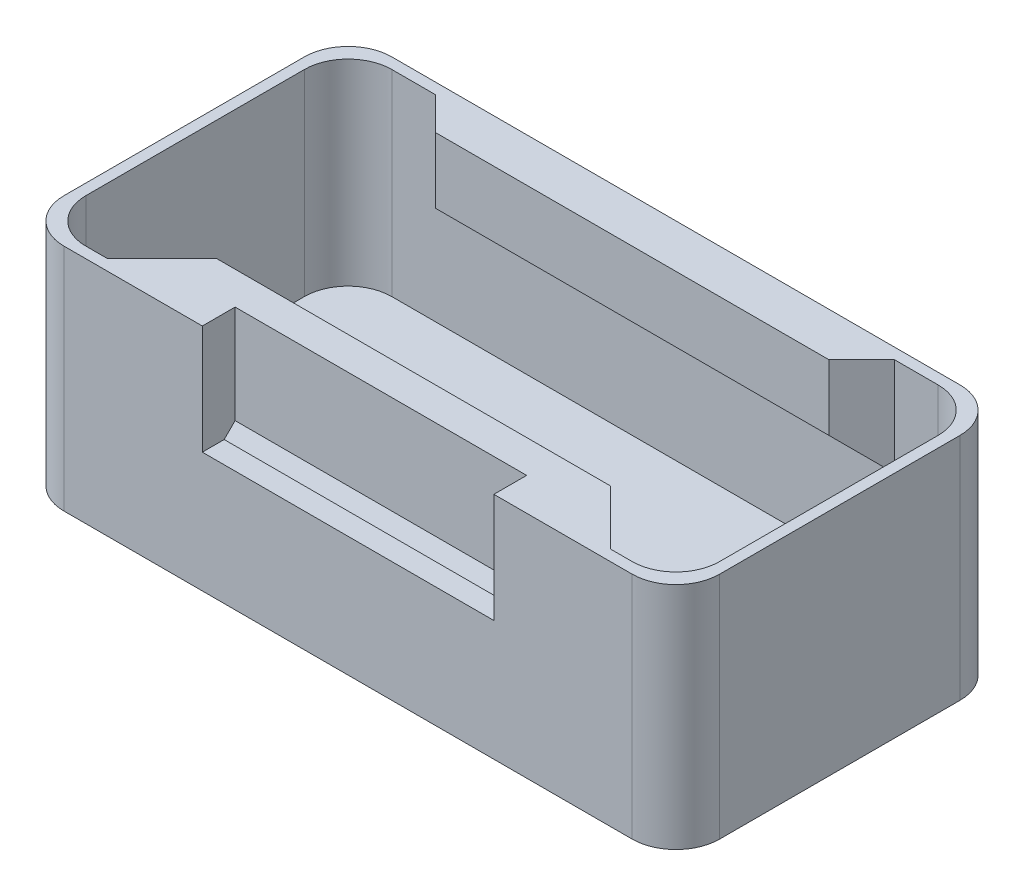
ISO-10303-21;
HEADER;
FILE_DESCRIPTION(('STEP AP214'),'2;1');
FILE_NAME('part.step','',(''),(''),'','','');
FILE_SCHEMA(('AUTOMOTIVE_DESIGN { 1 0 10303 214 1 1 1 1 }'));
ENDSEC;
DATA;
#1=APPLICATION_CONTEXT('core data for automotive mechanical design processes');
#2=APPLICATION_PROTOCOL_DEFINITION('international standard','automotive_design',2000,#1);
#3=PRODUCT_CONTEXT('',#1,'mechanical');
#4=PRODUCT('Part','Part','',(#3));
#5=PRODUCT_RELATED_PRODUCT_CATEGORY('part','',(#4));
#6=PRODUCT_DEFINITION_FORMATION('','',#4);
#7=PRODUCT_DEFINITION_CONTEXT('part definition',#1,'design');
#8=PRODUCT_DEFINITION('design','',#6,#7);
#9=PRODUCT_DEFINITION_SHAPE('','',#8);
#10=(LENGTH_UNIT() NAMED_UNIT(*) SI_UNIT(.MILLI.,.METRE.));
#11=(NAMED_UNIT(*) PLANE_ANGLE_UNIT() SI_UNIT($,.RADIAN.));
#12=(NAMED_UNIT(*) SI_UNIT($,.STERADIAN.) SOLID_ANGLE_UNIT());
#13=UNCERTAINTY_MEASURE_WITH_UNIT(LENGTH_MEASURE(1.E-05),#10,'distance_accuracy_value','');
#14=(GEOMETRIC_REPRESENTATION_CONTEXT(3) GLOBAL_UNCERTAINTY_ASSIGNED_CONTEXT((#13)) GLOBAL_UNIT_ASSIGNED_CONTEXT((#10,
#11,#12)) REPRESENTATION_CONTEXT('',''));
#15=CARTESIAN_POINT('',(0.,0.,0.));
#16=DIRECTION('',(0.,0.,1.));
#17=DIRECTION('',(1.,0.,0.));
#18=AXIS2_PLACEMENT_3D('',#15,#16,#17);
#19=CARTESIAN_POINT('',(0.,5.,0.));
#20=DIRECTION('',(0.,0.,-1.));
#21=DIRECTION('',(-1.,0.,0.));
#22=AXIS2_PLACEMENT_3D('',#19,#20,#21);
#23=PLANE('',#22);
#24=DIRECTION('',(0.,1.,0.));
#25=VECTOR('',#24,1.);
#26=CARTESIAN_POINT('',(83.2977765473117,55.,0.));
#27=LINE('',#26,#25);
#28=CARTESIAN_POINT('',(83.2977765473117,55.,0.));
#29=VERTEX_POINT('',#28);
#30=CARTESIAN_POINT('',(83.2977765473117,105.,0.));
#31=VERTEX_POINT('',#30);
#32=EDGE_CURVE('E485',#29,#31,#27,.T.);
#33=ORIENTED_EDGE('',*,*,#32,.T.);
#34=DIRECTION('',(1.,0.,0.));
#35=VECTOR('',#34,1.);
#36=CARTESIAN_POINT('',(0.,105.,0.));
#37=LINE('',#36,#35);
#38=CARTESIAN_POINT('',(20.,105.,0.));
#39=VERTEX_POINT('',#38);
#40=EDGE_CURVE('E363',#39,#31,#37,.T.);
#41=ORIENTED_EDGE('',*,*,#40,.F.);
#42=DIRECTION('',(0.,-1.,0.));
#43=VECTOR('',#42,1.);
#44=CARTESIAN_POINT('',(20.,5.,0.));
#45=LINE('',#44,#43);
#46=CARTESIAN_POINT('',(20.,0.,0.));
#47=VERTEX_POINT('',#46);
#48=EDGE_CURVE('E394',#39,#47,#45,.T.);
#49=ORIENTED_EDGE('',*,*,#48,.T.);
#50=DIRECTION('',(1.,0.,0.));
#51=VECTOR('',#50,1.);
#52=CARTESIAN_POINT('',(0.,0.,0.));
#53=LINE('',#52,#51);
#54=CARTESIAN_POINT('',(280.,0.,0.));
#55=VERTEX_POINT('',#54);
#56=EDGE_CURVE('E372',#47,#55,#53,.T.);
#57=ORIENTED_EDGE('',*,*,#56,.T.);
#58=DIRECTION('',(0.,-1.,0.));
#59=VECTOR('',#58,1.);
#60=CARTESIAN_POINT('',(280.,5.,0.));
#61=LINE('',#60,#59);
#62=CARTESIAN_POINT('',(280.,105.,0.));
#63=VERTEX_POINT('',#62);
#64=EDGE_CURVE('E397',#55,#63,#61,.F.);
#65=ORIENTED_EDGE('',*,*,#64,.T.);
#66=CARTESIAN_POINT('',(216.702223452688,105.,0.));
#67=VERTEX_POINT('',#66);
#68=EDGE_CURVE('E265',#67,#63,#37,.T.);
#69=ORIENTED_EDGE('',*,*,#68,.F.);
#70=DIRECTION('',(0.,1.,0.));
#71=VECTOR('',#70,1.);
#72=CARTESIAN_POINT('',(216.702223452688,55.,0.));
#73=LINE('',#72,#71);
#74=CARTESIAN_POINT('',(216.702223452688,55.,0.));
#75=VERTEX_POINT('',#74);
#76=EDGE_CURVE('E50',#75,#67,#73,.T.);
#77=ORIENTED_EDGE('',*,*,#76,.F.);
#78=DIRECTION('',(1.,0.,0.));
#79=VECTOR('',#78,1.);
#80=CARTESIAN_POINT('',(0.,55.,0.));
#81=LINE('',#80,#79);
#82=EDGE_CURVE('E253',#29,#75,#81,.T.);
#83=ORIENTED_EDGE('',*,*,#82,.F.);
#84=EDGE_LOOP('',(#33,#41,#49,#57,#65,#69,#77,#83));
#85=FACE_BOUND('',#84,.T.);
#86=ADVANCED_FACE('F35',(#85),#23,.F.);
#87=CARTESIAN_POINT('',(0.,105.,0.));
#88=DIRECTION('',(0.,1.,0.));
#89=DIRECTION('',(0.,0.,1.));
#90=AXIS2_PLACEMENT_3D('',#87,#88,#89);
#91=PLANE('',#90);
#92=DIRECTION('',(0.,0.,1.));
#93=VECTOR('',#92,1.);
#94=CARTESIAN_POINT('',(5.,105.,-145.));
#95=LINE('',#94,#93);
#96=CARTESIAN_POINT('',(5.,105.,-125.));
#97=VERTEX_POINT('',#96);
#98=CARTESIAN_POINT('',(5.,105.,-25.));
#99=VERTEX_POINT('',#98);
#100=EDGE_CURVE('E342',#97,#99,#95,.T.);
#101=ORIENTED_EDGE('',*,*,#100,.F.);
#102=CARTESIAN_POINT('',(25.,105.,-125.));
#103=DIRECTION('',(0.,1.,0.));
#104=DIRECTION('',(0.,0.,1.));
#105=AXIS2_PLACEMENT_3D('',#102,#103,#104);
#106=CIRCLE('',#105,20.);
#107=CARTESIAN_POINT('',(25.,105.,-145.));
#108=VERTEX_POINT('',#107);
#109=EDGE_CURVE('E444',#97,#108,#106,.F.);
#110=ORIENTED_EDGE('',*,*,#109,.T.);
#111=DIRECTION('',(-1.,0.,0.));
#112=VECTOR('',#111,1.);
#113=CARTESIAN_POINT('',(295.,105.,-145.));
#114=LINE('',#113,#112);
#115=CARTESIAN_POINT('',(45.0000000000001,105.,-145.));
#116=VERTEX_POINT('',#115);
#117=EDGE_CURVE('E343',#116,#108,#114,.T.);
#118=ORIENTED_EDGE('',*,*,#117,.F.);
#119=DIRECTION('',(0.707106781186544,0.,0.707106781186551));
#120=VECTOR('',#119,1.);
#121=CARTESIAN_POINT('',(60.,105.,-130.));
#122=LINE('',#121,#120);
#123=CARTESIAN_POINT('',(60.,105.,-130.));
#124=VERTEX_POINT('',#123);
#125=EDGE_CURVE('E463',#116,#124,#122,.T.);
#126=ORIENTED_EDGE('',*,*,#125,.T.);
#127=DIRECTION('',(-1.,0.,0.));
#128=VECTOR('',#127,1.);
#129=CARTESIAN_POINT('',(60.,105.,-130.));
#130=LINE('',#129,#128);
#131=CARTESIAN_POINT('',(240.,105.,-130.));
#132=VERTEX_POINT('',#131);
#133=EDGE_CURVE('E291',#132,#124,#130,.T.);
#134=ORIENTED_EDGE('',*,*,#133,.F.);
#135=DIRECTION('',(0.707106781186543,0.,-0.707106781186552));
#136=VECTOR('',#135,1.);
#137=CARTESIAN_POINT('',(240.,105.,-130.));
#138=LINE('',#137,#136);
#139=CARTESIAN_POINT('',(255.,105.,-145.));
#140=VERTEX_POINT('',#139);
#141=EDGE_CURVE('E461',#132,#140,#138,.T.);
#142=ORIENTED_EDGE('',*,*,#141,.T.);
#143=CARTESIAN_POINT('',(275.,105.,-145.));
#144=VERTEX_POINT('',#143);
#145=EDGE_CURVE('E339',#144,#140,#114,.T.);
#146=ORIENTED_EDGE('',*,*,#145,.F.);
#147=CARTESIAN_POINT('',(275.,105.,-125.));
#148=DIRECTION('',(0.,1.,0.));
#149=DIRECTION('',(0.,0.,1.));
#150=AXIS2_PLACEMENT_3D('',#147,#148,#149);
#151=CIRCLE('',#150,20.);
#152=CARTESIAN_POINT('',(295.,105.,-125.));
#153=VERTEX_POINT('',#152);
#154=EDGE_CURVE('E437',#144,#153,#151,.F.);
#155=ORIENTED_EDGE('',*,*,#154,.T.);
#156=DIRECTION('',(0.,0.,-1.));
#157=VECTOR('',#156,1.);
#158=CARTESIAN_POINT('',(295.,105.,-5.));
#159=LINE('',#158,#157);
#160=CARTESIAN_POINT('',(295.,105.,-25.));
#161=VERTEX_POINT('',#160);
#162=EDGE_CURVE('E350',#161,#153,#159,.T.);
#163=ORIENTED_EDGE('',*,*,#162,.F.);
#164=CARTESIAN_POINT('',(275.,105.,-25.));
#165=DIRECTION('',(0.,1.,0.));
#166=DIRECTION('',(0.,0.,1.));
#167=AXIS2_PLACEMENT_3D('',#164,#165,#166);
#168=CIRCLE('',#167,20.);
#169=CARTESIAN_POINT('',(275.,105.,-5.));
#170=VERTEX_POINT('',#169);
#171=EDGE_CURVE('E439',#161,#170,#168,.F.);
#172=ORIENTED_EDGE('',*,*,#171,.T.);
#173=DIRECTION('',(1.,0.,0.));
#174=VECTOR('',#173,1.);
#175=CARTESIAN_POINT('',(5.,105.,-5.));
#176=LINE('',#175,#174);
#177=CARTESIAN_POINT('',(265.,105.,-5.));
#178=VERTEX_POINT('',#177);
#179=EDGE_CURVE('E346',#178,#170,#176,.T.);
#180=ORIENTED_EDGE('',*,*,#179,.F.);
#181=DIRECTION('',(-0.707106781186544,0.,-0.707106781186551));
#182=VECTOR('',#181,1.);
#183=CARTESIAN_POINT('',(240.,105.,-30.0000000000002));
#184=LINE('',#183,#182);
#185=CARTESIAN_POINT('',(240.,105.,-30.));
#186=VERTEX_POINT('',#185);
#187=EDGE_CURVE('E479',#178,#186,#184,.T.);
#188=ORIENTED_EDGE('',*,*,#187,.T.);
#189=DIRECTION('',(1.,0.,0.));
#190=VECTOR('',#189,1.);
#191=CARTESIAN_POINT('',(60.,105.,-30.));
#192=LINE('',#191,#190);
#193=CARTESIAN_POINT('',(60.,105.,-30.));
#194=VERTEX_POINT('',#193);
#195=EDGE_CURVE('E276',#194,#186,#192,.T.);
#196=ORIENTED_EDGE('',*,*,#195,.F.);
#197=DIRECTION('',(-0.707106781186544,0.,0.707106781186551));
#198=VECTOR('',#197,1.);
#199=CARTESIAN_POINT('',(60.,105.,-30.0000000000002));
#200=LINE('',#199,#198);
#201=CARTESIAN_POINT('',(35.0000000000001,105.,-5.));
#202=VERTEX_POINT('',#201);
#203=EDGE_CURVE('E477',#194,#202,#200,.T.);
#204=ORIENTED_EDGE('',*,*,#203,.T.);
#205=CARTESIAN_POINT('',(25.,105.,-5.));
#206=VERTEX_POINT('',#205);
#207=EDGE_CURVE('E347',#206,#202,#176,.T.);
#208=ORIENTED_EDGE('',*,*,#207,.F.);
#209=CARTESIAN_POINT('',(25.,105.,-25.));
#210=DIRECTION('',(0.,1.,0.));
#211=DIRECTION('',(0.,0.,1.));
#212=AXIS2_PLACEMENT_3D('',#209,#210,#211);
#213=CIRCLE('',#212,20.);
#214=EDGE_CURVE('E442',#206,#99,#213,.F.);
#215=ORIENTED_EDGE('',*,*,#214,.T.);
#216=EDGE_LOOP('',(#101,#110,#118,#126,#134,#142,#146,#155,#163,#172,#180,#188,#196,#204,#208,#215));
#217=FACE_BOUND('',#216,.T.);
#218=ORIENTED_EDGE('',*,*,#40,.T.);
#219=DIRECTION('',(0.,0.,-1.));
#220=VECTOR('',#219,1.);
#221=CARTESIAN_POINT('',(83.2977765473117,105.,0.));
#222=LINE('',#221,#220);
#223=CARTESIAN_POINT('',(83.2977765473117,105.,-15.));
#224=VERTEX_POINT('',#223);
#225=EDGE_CURVE('E261',#31,#224,#222,.T.);
#226=ORIENTED_EDGE('',*,*,#225,.T.);
#227=DIRECTION('',(1.,0.,0.));
#228=VECTOR('',#227,1.);
#229=CARTESIAN_POINT('',(0.,105.,-15.));
#230=LINE('',#229,#228);
#231=CARTESIAN_POINT('',(216.702223452688,105.,-15.));
#232=VERTEX_POINT('',#231);
#233=EDGE_CURVE('E506',#224,#232,#230,.T.);
#234=ORIENTED_EDGE('',*,*,#233,.T.);
#235=DIRECTION('',(0.,0.,-1.));
#236=VECTOR('',#235,1.);
#237=CARTESIAN_POINT('',(216.702223452688,105.,0.));
#238=LINE('',#237,#236);
#239=EDGE_CURVE('E496',#67,#232,#238,.T.);
#240=ORIENTED_EDGE('',*,*,#239,.F.);
#241=ORIENTED_EDGE('',*,*,#68,.T.);
#242=CARTESIAN_POINT('',(280.,105.,-20.));
#243=DIRECTION('',(0.,1.,0.));
#244=DIRECTION('',(0.,0.,1.));
#245=AXIS2_PLACEMENT_3D('',#242,#243,#244);
#246=CIRCLE('',#245,20.);
#247=CARTESIAN_POINT('',(300.,105.,-20.));
#248=VERTEX_POINT('',#247);
#249=EDGE_CURVE('E453',#63,#248,#246,.T.);
#250=ORIENTED_EDGE('',*,*,#249,.T.);
#251=DIRECTION('',(0.,0.,-1.));
#252=VECTOR('',#251,1.);
#253=CARTESIAN_POINT('',(300.,105.,0.));
#254=LINE('',#253,#252);
#255=CARTESIAN_POINT('',(300.,105.,-130.));
#256=VERTEX_POINT('',#255);
#257=EDGE_CURVE('E366',#248,#256,#254,.T.);
#258=ORIENTED_EDGE('',*,*,#257,.T.);
#259=CARTESIAN_POINT('',(280.,105.,-130.));
#260=DIRECTION('',(0.,1.,0.));
#261=DIRECTION('',(0.,0.,1.));
#262=AXIS2_PLACEMENT_3D('',#259,#260,#261);
#263=CIRCLE('',#262,20.);
#264=CARTESIAN_POINT('',(280.,105.,-150.));
#265=VERTEX_POINT('',#264);
#266=EDGE_CURVE('E451',#256,#265,#263,.T.);
#267=ORIENTED_EDGE('',*,*,#266,.T.);
#268=DIRECTION('',(-1.,0.,0.));
#269=VECTOR('',#268,1.);
#270=CARTESIAN_POINT('',(300.,105.,-150.));
#271=LINE('',#270,#269);
#272=CARTESIAN_POINT('',(20.,105.,-150.));
#273=VERTEX_POINT('',#272);
#274=EDGE_CURVE('E353',#265,#273,#271,.T.);
#275=ORIENTED_EDGE('',*,*,#274,.T.);
#276=CARTESIAN_POINT('',(20.,105.,-130.));
#277=DIRECTION('',(0.,1.,0.));
#278=DIRECTION('',(0.,0.,1.));
#279=AXIS2_PLACEMENT_3D('',#276,#277,#278);
#280=CIRCLE('',#279,20.);
#281=CARTESIAN_POINT('',(0.,105.,-130.));
#282=VERTEX_POINT('',#281);
#283=EDGE_CURVE('E449',#273,#282,#280,.T.);
#284=ORIENTED_EDGE('',*,*,#283,.T.);
#285=DIRECTION('',(0.,0.,1.));
#286=VECTOR('',#285,1.);
#287=CARTESIAN_POINT('',(0.,105.,-150.));
#288=LINE('',#287,#286);
#289=CARTESIAN_POINT('',(0.,105.,-20.));
#290=VERTEX_POINT('',#289);
#291=EDGE_CURVE('E360',#282,#290,#288,.T.);
#292=ORIENTED_EDGE('',*,*,#291,.T.);
#293=CARTESIAN_POINT('',(20.,105.,-20.));
#294=DIRECTION('',(0.,1.,0.));
#295=DIRECTION('',(0.,0.,1.));
#296=AXIS2_PLACEMENT_3D('',#293,#294,#295);
#297=CIRCLE('',#296,20.);
#298=EDGE_CURVE('E447',#290,#39,#297,.T.);
#299=ORIENTED_EDGE('',*,*,#298,.T.);
#300=EDGE_LOOP('',(#218,#226,#234,#240,#241,#250,#258,#267,#275,#284,#292,#299));
#301=FACE_BOUND('',#300,.T.);
#302=ADVANCED_FACE('F509',(#217,#301),#91,.T.);
#303=CARTESIAN_POINT('',(60.,75.,-30.0000000000002));
#304=DIRECTION('',(0.,0.707106781186551,0.707106781186544));
#305=DIRECTION('',(-1.,0.,0.));
#306=AXIS2_PLACEMENT_3D('',#303,#304,#305);
#307=PLANE('',#306);
#308=DIRECTION('',(-0.577350269189624,0.577350269189624,-0.57735026918963));
#309=VECTOR('',#308,1.);
#310=CARTESIAN_POINT('',(230.,85.,-40.0000000000002));
#311=LINE('',#310,#309);
#312=CARTESIAN_POINT('',(240.,75.,-30.));
#313=VERTEX_POINT('',#312);
#314=CARTESIAN_POINT('',(265.,50.0000000000001,-5.));
#315=VERTEX_POINT('',#314);
#316=EDGE_CURVE('E469',#313,#315,#311,.F.);
#317=ORIENTED_EDGE('',*,*,#316,.T.);
#318=DIRECTION('',(1.,0.,0.));
#319=VECTOR('',#318,1.);
#320=CARTESIAN_POINT('',(5.,50.0000000000001,-5.));
#321=LINE('',#320,#319);
#322=CARTESIAN_POINT('',(35.0000000000001,50.0000000000001,-5.));
#323=VERTEX_POINT('',#322);
#324=EDGE_CURVE('E473',#323,#315,#321,.T.);
#325=ORIENTED_EDGE('',*,*,#324,.F.);
#326=DIRECTION('',(0.577350269189624,0.577350269189624,-0.57735026918963));
#327=VECTOR('',#326,1.);
#328=CARTESIAN_POINT('',(60.,75.,-30.0000000000002));
#329=LINE('',#328,#327);
#330=CARTESIAN_POINT('',(60.,75.,-30.));
#331=VERTEX_POINT('',#330);
#332=EDGE_CURVE('E482',#331,#323,#329,.F.);
#333=ORIENTED_EDGE('',*,*,#332,.F.);
#334=DIRECTION('',(-1.,0.,0.));
#335=VECTOR('',#334,1.);
#336=CARTESIAN_POINT('',(60.,75.,-30.));
#337=LINE('',#336,#335);
#338=EDGE_CURVE('E282',#313,#331,#337,.T.);
#339=ORIENTED_EDGE('',*,*,#338,.F.);
#340=EDGE_LOOP('',(#317,#325,#333,#339));
#341=FACE_BOUND('',#340,.T.);
#342=DIRECTION('',(0.,0.707106781186544,-0.707106781186551));
#343=VECTOR('',#342,1.);
#344=CARTESIAN_POINT('',(83.2977765473117,75.,-30.0000000000002));
#345=LINE('',#344,#343);
#346=CARTESIAN_POINT('',(83.2977765473117,55.,-9.99999999999993));
#347=VERTEX_POINT('',#346);
#348=CARTESIAN_POINT('',(83.2977765473117,60.,-15.));
#349=VERTEX_POINT('',#348);
#350=EDGE_CURVE('E11',#347,#349,#345,.T.);
#351=ORIENTED_EDGE('',*,*,#350,.F.);
#352=DIRECTION('',(-1.,0.,0.));
#353=VECTOR('',#352,1.);
#354=CARTESIAN_POINT('',(60.,55.,-9.99999999999993));
#355=LINE('',#354,#353);
#356=CARTESIAN_POINT('',(216.702223452688,55.,-9.99999999999993));
#357=VERTEX_POINT('',#356);
#358=EDGE_CURVE('E481',#357,#347,#355,.T.);
#359=ORIENTED_EDGE('',*,*,#358,.F.);
#360=DIRECTION('',(0.,0.707106781186544,-0.707106781186551));
#361=VECTOR('',#360,1.);
#362=CARTESIAN_POINT('',(216.702223452688,75.,-30.0000000000002));
#363=LINE('',#362,#361);
#364=CARTESIAN_POINT('',(216.702223452688,60.,-15.));
#365=VERTEX_POINT('',#364);
#366=EDGE_CURVE('E250',#357,#365,#363,.T.);
#367=ORIENTED_EDGE('',*,*,#366,.T.);
#368=DIRECTION('',(1.,0.,0.));
#369=VECTOR('',#368,1.);
#370=CARTESIAN_POINT('',(60.,60.,-15.));
#371=LINE('',#370,#369);
#372=EDGE_CURVE('E43',#349,#365,#371,.T.);
#373=ORIENTED_EDGE('',*,*,#372,.F.);
#374=EDGE_LOOP('',(#351,#359,#367,#373));
#375=FACE_BOUND('',#374,.T.);
#376=ADVANCED_FACE('F498',(#341,#375),#307,.F.);
#377=CARTESIAN_POINT('',(5.,105.,-5.));
#378=DIRECTION('',(0.,0.,-1.));
#379=DIRECTION('',(-1.,0.,0.));
#380=AXIS2_PLACEMENT_3D('',#377,#378,#379);
#381=PLANE('',#380);
#382=ORIENTED_EDGE('',*,*,#207,.T.);
#383=DIRECTION('',(0.,-1.,0.));
#384=VECTOR('',#383,1.);
#385=CARTESIAN_POINT('',(35.0000000000001,105.,-5.));
#386=LINE('',#385,#384);
#387=EDGE_CURVE('E475',#202,#323,#386,.T.);
#388=ORIENTED_EDGE('',*,*,#387,.T.);
#389=ORIENTED_EDGE('',*,*,#324,.T.);
#390=DIRECTION('',(0.,1.,0.));
#391=VECTOR('',#390,1.);
#392=CARTESIAN_POINT('',(265.,105.,-5.));
#393=LINE('',#392,#391);
#394=EDGE_CURVE('E465',#315,#178,#393,.T.);
#395=ORIENTED_EDGE('',*,*,#394,.T.);
#396=ORIENTED_EDGE('',*,*,#179,.T.);
#397=DIRECTION('',(0.,-1.,0.));
#398=VECTOR('',#397,1.);
#399=CARTESIAN_POINT('',(275.,15.,-5.));
#400=LINE('',#399,#398);
#401=CARTESIAN_POINT('',(275.,15.,-5.));
#402=VERTEX_POINT('',#401);
#403=EDGE_CURVE('E425',#170,#402,#400,.T.);
#404=ORIENTED_EDGE('',*,*,#403,.T.);
#405=DIRECTION('',(1.,0.,0.));
#406=VECTOR('',#405,1.);
#407=CARTESIAN_POINT('',(0.,15.,-5.));
#408=LINE('',#407,#406);
#409=CARTESIAN_POINT('',(25.,15.,-5.));
#410=VERTEX_POINT('',#409);
#411=EDGE_CURVE('E307',#410,#402,#408,.T.);
#412=ORIENTED_EDGE('',*,*,#411,.F.);
#413=DIRECTION('',(0.,-1.,0.));
#414=VECTOR('',#413,1.);
#415=CARTESIAN_POINT('',(25.,105.,-5.));
#416=LINE('',#415,#414);
#417=EDGE_CURVE('E423',#410,#206,#416,.F.);
#418=ORIENTED_EDGE('',*,*,#417,.T.);
#419=EDGE_LOOP('',(#382,#388,#389,#395,#396,#404,#412,#418));
#420=FACE_BOUND('',#419,.T.);
#421=ADVANCED_FACE('F681',(#420),#381,.T.);
#422=CARTESIAN_POINT('',(295.,105.,-145.));
#423=DIRECTION('',(0.,0.,1.));
#424=DIRECTION('',(1.,0.,0.));
#425=AXIS2_PLACEMENT_3D('',#422,#423,#424);
#426=PLANE('',#425);
#427=ORIENTED_EDGE('',*,*,#145,.T.);
#428=DIRECTION('',(0.,-1.,0.));
#429=VECTOR('',#428,1.);
#430=CARTESIAN_POINT('',(255.,105.,-145.));
#431=LINE('',#430,#429);
#432=CARTESIAN_POINT('',(255.,60.0000000000001,-145.));
#433=VERTEX_POINT('',#432);
#434=EDGE_CURVE('E459',#140,#433,#431,.T.);
#435=ORIENTED_EDGE('',*,*,#434,.T.);
#436=DIRECTION('',(-1.,0.,0.));
#437=VECTOR('',#436,1.);
#438=CARTESIAN_POINT('',(295.,60.0000000000001,-145.));
#439=LINE('',#438,#437);
#440=CARTESIAN_POINT('',(45.0000000000001,60.0000000000001,-145.));
#441=VERTEX_POINT('',#440);
#442=EDGE_CURVE('E457',#433,#441,#439,.T.);
#443=ORIENTED_EDGE('',*,*,#442,.T.);
#444=DIRECTION('',(0.,1.,0.));
#445=VECTOR('',#444,1.);
#446=CARTESIAN_POINT('',(45.0000000000001,105.,-145.));
#447=LINE('',#446,#445);
#448=EDGE_CURVE('E455',#441,#116,#447,.T.);
#449=ORIENTED_EDGE('',*,*,#448,.T.);
#450=ORIENTED_EDGE('',*,*,#117,.T.);
#451=DIRECTION('',(0.,-1.,0.));
#452=VECTOR('',#451,1.);
#453=CARTESIAN_POINT('',(25.,15.,-145.));
#454=LINE('',#453,#452);
#455=CARTESIAN_POINT('',(25.,15.,-145.));
#456=VERTEX_POINT('',#455);
#457=EDGE_CURVE('E418',#108,#456,#454,.T.);
#458=ORIENTED_EDGE('',*,*,#457,.T.);
#459=DIRECTION('',(-1.,0.,0.));
#460=VECTOR('',#459,1.);
#461=CARTESIAN_POINT('',(0.,15.,-145.));
#462=LINE('',#461,#460);
#463=CARTESIAN_POINT('',(275.,15.,-145.));
#464=VERTEX_POINT('',#463);
#465=EDGE_CURVE('E327',#464,#456,#462,.T.);
#466=ORIENTED_EDGE('',*,*,#465,.F.);
#467=DIRECTION('',(0.,-1.,0.));
#468=VECTOR('',#467,1.);
#469=CARTESIAN_POINT('',(275.,105.,-145.));
#470=LINE('',#469,#468);
#471=EDGE_CURVE('E421',#464,#144,#470,.F.);
#472=ORIENTED_EDGE('',*,*,#471,.T.);
#473=EDGE_LOOP('',(#427,#435,#443,#449,#450,#458,#466,#472));
#474=FACE_BOUND('',#473,.T.);
#475=ADVANCED_FACE('F643',(#474),#426,.T.);
#476=CARTESIAN_POINT('',(5.,105.,-145.));
#477=DIRECTION('',(1.,0.,0.));
#478=DIRECTION('',(0.,0.,-1.));
#479=AXIS2_PLACEMENT_3D('',#476,#477,#478);
#480=PLANE('',#479);
#481=ORIENTED_EDGE('',*,*,#100,.T.);
#482=DIRECTION('',(0.,-1.,0.));
#483=VECTOR('',#482,1.);
#484=CARTESIAN_POINT('',(5.,15.,-25.));
#485=LINE('',#484,#483);
#486=CARTESIAN_POINT('',(5.,15.,-25.));
#487=VERTEX_POINT('',#486);
#488=EDGE_CURVE('E434',#99,#487,#485,.T.);
#489=ORIENTED_EDGE('',*,*,#488,.T.);
#490=DIRECTION('',(0.,0.,1.));
#491=VECTOR('',#490,1.);
#492=CARTESIAN_POINT('',(5.,15.,0.));
#493=LINE('',#492,#491);
#494=CARTESIAN_POINT('',(5.,15.,-65.));
#495=VERTEX_POINT('',#494);
#496=EDGE_CURVE('E304',#495,#487,#493,.T.);
#497=ORIENTED_EDGE('',*,*,#496,.F.);
#498=DIRECTION('',(0.,-1.,0.));
#499=VECTOR('',#498,1.);
#500=CARTESIAN_POINT('',(5.,15.,-65.));
#501=LINE('',#500,#499);
#502=CARTESIAN_POINT('',(5.,5.,-65.));
#503=VERTEX_POINT('',#502);
#504=EDGE_CURVE('E316',#495,#503,#501,.T.);
#505=ORIENTED_EDGE('',*,*,#504,.T.);
#506=DIRECTION('',(0.,0.,1.));
#507=VECTOR('',#506,1.);
#508=CARTESIAN_POINT('',(5.,5.,-145.));
#509=LINE('',#508,#507);
#510=CARTESIAN_POINT('',(5.,5.,-95.));
#511=VERTEX_POINT('',#510);
#512=EDGE_CURVE('E338',#511,#503,#509,.T.);
#513=ORIENTED_EDGE('',*,*,#512,.F.);
#514=DIRECTION('',(0.,-1.,0.));
#515=VECTOR('',#514,1.);
#516=CARTESIAN_POINT('',(5.,15.,-95.));
#517=LINE('',#516,#515);
#518=CARTESIAN_POINT('',(5.,15.,-95.));
#519=VERTEX_POINT('',#518);
#520=EDGE_CURVE('E335',#519,#511,#517,.T.);
#521=ORIENTED_EDGE('',*,*,#520,.F.);
#522=DIRECTION('',(0.,0.,1.));
#523=VECTOR('',#522,1.);
#524=CARTESIAN_POINT('',(5.,15.,0.));
#525=LINE('',#524,#523);
#526=CARTESIAN_POINT('',(5.,15.,-125.));
#527=VERTEX_POINT('',#526);
#528=EDGE_CURVE('E319',#527,#519,#525,.T.);
#529=ORIENTED_EDGE('',*,*,#528,.F.);
#530=DIRECTION('',(0.,-1.,0.));
#531=VECTOR('',#530,1.);
#532=CARTESIAN_POINT('',(5.,105.,-125.));
#533=LINE('',#532,#531);
#534=EDGE_CURVE('E432',#527,#97,#533,.F.);
#535=ORIENTED_EDGE('',*,*,#534,.T.);
#536=EDGE_LOOP('',(#481,#489,#497,#505,#513,#521,#529,#535));
#537=FACE_BOUND('',#536,.T.);
#538=ADVANCED_FACE('F578',(#537),#480,.T.);
#539=CARTESIAN_POINT('',(295.,105.,-5.));
#540=DIRECTION('',(-1.,0.,0.));
#541=DIRECTION('',(0.,0.,1.));
#542=AXIS2_PLACEMENT_3D('',#539,#540,#541);
#543=PLANE('',#542);
#544=ORIENTED_EDGE('',*,*,#162,.T.);
#545=DIRECTION('',(0.,-1.,0.));
#546=VECTOR('',#545,1.);
#547=CARTESIAN_POINT('',(295.,15.,-125.));
#548=LINE('',#547,#546);
#549=CARTESIAN_POINT('',(295.,15.,-125.));
#550=VERTEX_POINT('',#549);
#551=EDGE_CURVE('E411',#153,#550,#548,.T.);
#552=ORIENTED_EDGE('',*,*,#551,.T.);
#553=DIRECTION('',(0.,0.,-1.));
#554=VECTOR('',#553,1.);
#555=CARTESIAN_POINT('',(295.,15.,0.));
#556=LINE('',#555,#554);
#557=CARTESIAN_POINT('',(295.,15.,-95.));
#558=VERTEX_POINT('',#557);
#559=EDGE_CURVE('E324',#558,#550,#556,.T.);
#560=ORIENTED_EDGE('',*,*,#559,.F.);
#561=DIRECTION('',(0.,-1.,0.));
#562=VECTOR('',#561,1.);
#563=CARTESIAN_POINT('',(295.,15.,-95.));
#564=LINE('',#563,#562);
#565=CARTESIAN_POINT('',(295.,5.,-95.));
#566=VERTEX_POINT('',#565);
#567=EDGE_CURVE('E330',#558,#566,#564,.T.);
#568=ORIENTED_EDGE('',*,*,#567,.T.);
#569=DIRECTION('',(0.,0.,-1.));
#570=VECTOR('',#569,1.);
#571=CARTESIAN_POINT('',(295.,5.,-5.));
#572=LINE('',#571,#570);
#573=CARTESIAN_POINT('',(295.,5.,-65.));
#574=VERTEX_POINT('',#573);
#575=EDGE_CURVE('E356',#574,#566,#572,.T.);
#576=ORIENTED_EDGE('',*,*,#575,.F.);
#577=DIRECTION('',(0.,-1.,0.));
#578=VECTOR('',#577,1.);
#579=CARTESIAN_POINT('',(295.,15.,-65.));
#580=LINE('',#579,#578);
#581=CARTESIAN_POINT('',(295.,15.,-65.));
#582=VERTEX_POINT('',#581);
#583=EDGE_CURVE('E312',#582,#574,#580,.T.);
#584=ORIENTED_EDGE('',*,*,#583,.F.);
#585=DIRECTION('',(0.,0.,-1.));
#586=VECTOR('',#585,1.);
#587=CARTESIAN_POINT('',(295.,15.,0.));
#588=LINE('',#587,#586);
#589=CARTESIAN_POINT('',(295.,15.,-25.));
#590=VERTEX_POINT('',#589);
#591=EDGE_CURVE('E310',#590,#582,#588,.T.);
#592=ORIENTED_EDGE('',*,*,#591,.F.);
#593=DIRECTION('',(0.,-1.,0.));
#594=VECTOR('',#593,1.);
#595=CARTESIAN_POINT('',(295.,105.,-25.));
#596=LINE('',#595,#594);
#597=EDGE_CURVE('E409',#590,#161,#596,.F.);
#598=ORIENTED_EDGE('',*,*,#597,.T.);
#599=EDGE_LOOP('',(#544,#552,#560,#568,#576,#584,#592,#598));
#600=FACE_BOUND('',#599,.T.);
#601=ADVANCED_FACE('F572',(#600),#543,.T.);
#602=CARTESIAN_POINT('',(0.,5.,0.));
#603=DIRECTION('',(0.,-1.,0.));
#604=DIRECTION('',(0.,0.,-1.));
#605=AXIS2_PLACEMENT_3D('',#602,#603,#604);
#606=PLANE('',#605);
#607=CARTESIAN_POINT('',(150.,5.,-80.));
#608=DIRECTION('',(0.,1.,0.));
#609=DIRECTION('',(0.,0.,1.));
#610=AXIS2_PLACEMENT_3D('',#607,#608,#609);
#611=CIRCLE('',#610,12.);
#612=CARTESIAN_POINT('',(150.,5.,-68.));
#613=VERTEX_POINT('',#612);
#614=EDGE_CURVE('E294',#613,#613,#611,.T.);
#615=ORIENTED_EDGE('',*,*,#614,.F.);
#616=EDGE_LOOP('',(#615));
#617=FACE_BOUND('',#616,.T.);
#618=ORIENTED_EDGE('',*,*,#512,.T.);
#619=DIRECTION('',(1.,0.,0.));
#620=VECTOR('',#619,1.);
#621=CARTESIAN_POINT('',(0.,5.,-65.));
#622=LINE('',#621,#620);
#623=EDGE_CURVE('E298',#503,#574,#622,.T.);
#624=ORIENTED_EDGE('',*,*,#623,.T.);
#625=ORIENTED_EDGE('',*,*,#575,.T.);
#626=DIRECTION('',(1.,0.,0.));
#627=VECTOR('',#626,1.);
#628=CARTESIAN_POINT('',(0.,5.,-95.));
#629=LINE('',#628,#627);
#630=EDGE_CURVE('E318',#511,#566,#629,.T.);
#631=ORIENTED_EDGE('',*,*,#630,.F.);
#632=EDGE_LOOP('',(#618,#624,#625,#631));
#633=FACE_BOUND('',#632,.T.);
#634=ADVANCED_FACE('F567',(#617,#633),#606,.F.);
#635=CARTESIAN_POINT('',(0.,5.,0.));
#636=DIRECTION('',(1.,0.,0.));
#637=DIRECTION('',(0.,0.,-1.));
#638=AXIS2_PLACEMENT_3D('',#635,#636,#637);
#639=PLANE('',#638);
#640=ORIENTED_EDGE('',*,*,#291,.F.);
#641=DIRECTION('',(0.,-1.,0.));
#642=VECTOR('',#641,1.);
#643=CARTESIAN_POINT('',(0.,5.,-130.));
#644=LINE('',#643,#642);
#645=CARTESIAN_POINT('',(0.,0.,-130.));
#646=VERTEX_POINT('',#645);
#647=EDGE_CURVE('E406',#282,#646,#644,.T.);
#648=ORIENTED_EDGE('',*,*,#647,.T.);
#649=DIRECTION('',(0.,0.,1.));
#650=VECTOR('',#649,1.);
#651=CARTESIAN_POINT('',(0.,0.,0.));
#652=LINE('',#651,#650);
#653=CARTESIAN_POINT('',(0.,0.,-20.));
#654=VERTEX_POINT('',#653);
#655=EDGE_CURVE('E369',#646,#654,#652,.T.);
#656=ORIENTED_EDGE('',*,*,#655,.T.);
#657=DIRECTION('',(0.,-1.,0.));
#658=VECTOR('',#657,1.);
#659=CARTESIAN_POINT('',(0.,5.,-20.));
#660=LINE('',#659,#658);
#661=EDGE_CURVE('E404',#654,#290,#660,.F.);
#662=ORIENTED_EDGE('',*,*,#661,.T.);
#663=EDGE_LOOP('',(#640,#648,#656,#662));
#664=FACE_BOUND('',#663,.T.);
#665=ADVANCED_FACE('F522',(#664),#639,.F.);
#666=CARTESIAN_POINT('',(300.,5.,0.));
#667=DIRECTION('',(-1.,0.,0.));
#668=DIRECTION('',(0.,0.,1.));
#669=AXIS2_PLACEMENT_3D('',#666,#667,#668);
#670=PLANE('',#669);
#671=ORIENTED_EDGE('',*,*,#257,.F.);
#672=DIRECTION('',(0.,-1.,0.));
#673=VECTOR('',#672,1.);
#674=CARTESIAN_POINT('',(300.,5.,-20.));
#675=LINE('',#674,#673);
#676=CARTESIAN_POINT('',(300.,0.,-20.));
#677=VERTEX_POINT('',#676);
#678=EDGE_CURVE('E383',#248,#677,#675,.T.);
#679=ORIENTED_EDGE('',*,*,#678,.T.);
#680=DIRECTION('',(0.,0.,-1.));
#681=VECTOR('',#680,1.);
#682=CARTESIAN_POINT('',(300.,0.,0.));
#683=LINE('',#682,#681);
#684=CARTESIAN_POINT('',(300.,0.,-130.));
#685=VERTEX_POINT('',#684);
#686=EDGE_CURVE('E375',#677,#685,#683,.T.);
#687=ORIENTED_EDGE('',*,*,#686,.T.);
#688=DIRECTION('',(0.,-1.,0.));
#689=VECTOR('',#688,1.);
#690=CARTESIAN_POINT('',(300.,5.,-130.));
#691=LINE('',#690,#689);
#692=EDGE_CURVE('E381',#685,#256,#691,.F.);
#693=ORIENTED_EDGE('',*,*,#692,.T.);
#694=EDGE_LOOP('',(#671,#679,#687,#693));
#695=FACE_BOUND('',#694,.T.);
#696=ADVANCED_FACE('F539',(#695),#670,.F.);
#697=CARTESIAN_POINT('',(0.,5.,-150.));
#698=DIRECTION('',(0.,0.,1.));
#699=DIRECTION('',(1.,0.,0.));
#700=AXIS2_PLACEMENT_3D('',#697,#698,#699);
#701=PLANE('',#700);
#702=ORIENTED_EDGE('',*,*,#274,.F.);
#703=DIRECTION('',(0.,-1.,0.));
#704=VECTOR('',#703,1.);
#705=CARTESIAN_POINT('',(280.,5.,-150.));
#706=LINE('',#705,#704);
#707=CARTESIAN_POINT('',(280.,0.,-150.));
#708=VERTEX_POINT('',#707);
#709=EDGE_CURVE('E401',#265,#708,#706,.T.);
#710=ORIENTED_EDGE('',*,*,#709,.T.);
#711=DIRECTION('',(-1.,0.,0.));
#712=VECTOR('',#711,1.);
#713=CARTESIAN_POINT('',(0.,0.,-150.));
#714=LINE('',#713,#712);
#715=CARTESIAN_POINT('',(20.,0.,-150.));
#716=VERTEX_POINT('',#715);
#717=EDGE_CURVE('E378',#708,#716,#714,.T.);
#718=ORIENTED_EDGE('',*,*,#717,.T.);
#719=DIRECTION('',(0.,-1.,0.));
#720=VECTOR('',#719,1.);
#721=CARTESIAN_POINT('',(20.,5.,-150.));
#722=LINE('',#721,#720);
#723=EDGE_CURVE('E399',#716,#273,#722,.F.);
#724=ORIENTED_EDGE('',*,*,#723,.T.);
#725=EDGE_LOOP('',(#702,#710,#718,#724));
#726=FACE_BOUND('',#725,.T.);
#727=ADVANCED_FACE('F531',(#726),#701,.F.);
#728=CARTESIAN_POINT('',(0.,0.,0.));
#729=DIRECTION('',(0.,-1.,0.));
#730=DIRECTION('',(0.,0.,-1.));
#731=AXIS2_PLACEMENT_3D('',#728,#729,#730);
#732=PLANE('',#731);
#733=CARTESIAN_POINT('',(150.,0.,-80.));
#734=DIRECTION('',(0.,1.,0.));
#735=DIRECTION('',(0.,0.,1.));
#736=AXIS2_PLACEMENT_3D('',#733,#734,#735);
#737=CIRCLE('',#736,12.);
#738=CARTESIAN_POINT('',(150.,0.,-68.));
#739=VERTEX_POINT('',#738);
#740=EDGE_CURVE('E295',#739,#739,#737,.T.);
#741=ORIENTED_EDGE('',*,*,#740,.T.);
#742=EDGE_LOOP('',(#741));
#743=FACE_BOUND('',#742,.T.);
#744=ORIENTED_EDGE('',*,*,#686,.F.);
#745=CARTESIAN_POINT('',(280.,0.,-20.));
#746=DIRECTION('',(0.,-1.,0.));
#747=DIRECTION('',(0.,0.,-1.));
#748=AXIS2_PLACEMENT_3D('',#745,#746,#747);
#749=CIRCLE('',#748,20.);
#750=EDGE_CURVE('E392',#677,#55,#749,.T.);
#751=ORIENTED_EDGE('',*,*,#750,.T.);
#752=ORIENTED_EDGE('',*,*,#56,.F.);
#753=CARTESIAN_POINT('',(20.,0.,-20.));
#754=DIRECTION('',(0.,-1.,0.));
#755=DIRECTION('',(0.,0.,-1.));
#756=AXIS2_PLACEMENT_3D('',#753,#754,#755);
#757=CIRCLE('',#756,20.);
#758=EDGE_CURVE('E386',#47,#654,#757,.T.);
#759=ORIENTED_EDGE('',*,*,#758,.T.);
#760=ORIENTED_EDGE('',*,*,#655,.F.);
#761=CARTESIAN_POINT('',(20.,0.,-130.));
#762=DIRECTION('',(0.,-1.,0.));
#763=DIRECTION('',(0.,0.,-1.));
#764=AXIS2_PLACEMENT_3D('',#761,#762,#763);
#765=CIRCLE('',#764,20.);
#766=EDGE_CURVE('E388',#646,#716,#765,.T.);
#767=ORIENTED_EDGE('',*,*,#766,.T.);
#768=ORIENTED_EDGE('',*,*,#717,.F.);
#769=CARTESIAN_POINT('',(280.,0.,-130.));
#770=DIRECTION('',(0.,-1.,0.));
#771=DIRECTION('',(0.,0.,-1.));
#772=AXIS2_PLACEMENT_3D('',#769,#770,#771);
#773=CIRCLE('',#772,20.);
#774=EDGE_CURVE('E390',#708,#685,#773,.T.);
#775=ORIENTED_EDGE('',*,*,#774,.T.);
#776=EDGE_LOOP('',(#744,#751,#752,#759,#760,#767,#768,#775));
#777=FACE_BOUND('',#776,.T.);
#778=ADVANCED_FACE('F519',(#743,#777),#732,.T.);
#779=CARTESIAN_POINT('',(0.,15.,-95.));
#780=DIRECTION('',(0.,0.,-1.));
#781=DIRECTION('',(-1.,0.,0.));
#782=AXIS2_PLACEMENT_3D('',#779,#780,#781);
#783=PLANE('',#782);
#784=ORIENTED_EDGE('',*,*,#630,.T.);
#785=ORIENTED_EDGE('',*,*,#567,.F.);
#786=DIRECTION('',(1.,0.,0.));
#787=VECTOR('',#786,1.);
#788=CARTESIAN_POINT('',(0.,15.,-95.));
#789=LINE('',#788,#787);
#790=EDGE_CURVE('E321',#519,#558,#789,.T.);
#791=ORIENTED_EDGE('',*,*,#790,.F.);
#792=ORIENTED_EDGE('',*,*,#520,.T.);
#793=EDGE_LOOP('',(#784,#785,#791,#792));
#794=FACE_BOUND('',#793,.T.);
#795=ADVANCED_FACE('F586',(#794),#783,.F.);
#796=CARTESIAN_POINT('',(0.,15.,0.));
#797=DIRECTION('',(0.,1.,0.));
#798=DIRECTION('',(0.,0.,1.));
#799=AXIS2_PLACEMENT_3D('',#796,#797,#798);
#800=PLANE('',#799);
#801=ORIENTED_EDGE('',*,*,#559,.T.);
#802=CARTESIAN_POINT('',(275.,15.,-125.));
#803=DIRECTION('',(0.,1.,0.));
#804=DIRECTION('',(0.,0.,1.));
#805=AXIS2_PLACEMENT_3D('',#802,#803,#804);
#806=CIRCLE('',#805,20.);
#807=EDGE_CURVE('E416',#550,#464,#806,.T.);
#808=ORIENTED_EDGE('',*,*,#807,.T.);
#809=ORIENTED_EDGE('',*,*,#465,.T.);
#810=CARTESIAN_POINT('',(25.,15.,-125.));
#811=DIRECTION('',(0.,1.,0.));
#812=DIRECTION('',(0.,0.,1.));
#813=AXIS2_PLACEMENT_3D('',#810,#811,#812);
#814=CIRCLE('',#813,20.);
#815=EDGE_CURVE('E414',#456,#527,#814,.T.);
#816=ORIENTED_EDGE('',*,*,#815,.T.);
#817=ORIENTED_EDGE('',*,*,#528,.T.);
#818=ORIENTED_EDGE('',*,*,#790,.T.);
#819=EDGE_LOOP('',(#801,#808,#809,#816,#817,#818));
#820=FACE_BOUND('',#819,.T.);
#821=ADVANCED_FACE('F604',(#820),#800,.T.);
#822=CARTESIAN_POINT('',(0.,15.,-65.));
#823=DIRECTION('',(0.,0.,-1.));
#824=DIRECTION('',(-1.,0.,0.));
#825=AXIS2_PLACEMENT_3D('',#822,#823,#824);
#826=PLANE('',#825);
#827=ORIENTED_EDGE('',*,*,#623,.F.);
#828=ORIENTED_EDGE('',*,*,#504,.F.);
#829=DIRECTION('',(1.,0.,0.));
#830=VECTOR('',#829,1.);
#831=CARTESIAN_POINT('',(0.,15.,-65.));
#832=LINE('',#831,#830);
#833=EDGE_CURVE('E301',#495,#582,#832,.T.);
#834=ORIENTED_EDGE('',*,*,#833,.T.);
#835=ORIENTED_EDGE('',*,*,#583,.T.);
#836=EDGE_LOOP('',(#827,#828,#834,#835));
#837=FACE_BOUND('',#836,.T.);
#838=ADVANCED_FACE('F612',(#837),#826,.T.);
#839=CARTESIAN_POINT('',(0.,15.,0.));
#840=DIRECTION('',(0.,1.,0.));
#841=DIRECTION('',(0.,0.,1.));
#842=AXIS2_PLACEMENT_3D('',#839,#840,#841);
#843=PLANE('',#842);
#844=ORIENTED_EDGE('',*,*,#411,.T.);
#845=CARTESIAN_POINT('',(275.,15.,-25.));
#846=DIRECTION('',(0.,1.,0.));
#847=DIRECTION('',(0.,0.,1.));
#848=AXIS2_PLACEMENT_3D('',#845,#846,#847);
#849=CIRCLE('',#848,20.);
#850=EDGE_CURVE('E430',#402,#590,#849,.T.);
#851=ORIENTED_EDGE('',*,*,#850,.T.);
#852=ORIENTED_EDGE('',*,*,#591,.T.);
#853=ORIENTED_EDGE('',*,*,#833,.F.);
#854=ORIENTED_EDGE('',*,*,#496,.T.);
#855=CARTESIAN_POINT('',(25.,15.,-25.));
#856=DIRECTION('',(0.,1.,0.));
#857=DIRECTION('',(0.,0.,1.));
#858=AXIS2_PLACEMENT_3D('',#855,#856,#857);
#859=CIRCLE('',#858,20.);
#860=EDGE_CURVE('E428',#487,#410,#859,.T.);
#861=ORIENTED_EDGE('',*,*,#860,.T.);
#862=EDGE_LOOP('',(#844,#851,#852,#853,#854,#861));
#863=FACE_BOUND('',#862,.T.);
#864=ADVANCED_FACE('F553',(#863),#843,.T.);
#865=CARTESIAN_POINT('',(150.,0.,-80.));
#866=DIRECTION('',(0.,1.,0.));
#867=DIRECTION('',(0.,0.,1.));
#868=AXIS2_PLACEMENT_3D('',#865,#866,#867);
#869=CYLINDRICAL_SURFACE('',#868,12.);
#870=ORIENTED_EDGE('',*,*,#740,.F.);
#871=EDGE_LOOP('',(#870));
#872=FACE_BOUND('',#871,.T.);
#873=ORIENTED_EDGE('',*,*,#614,.T.);
#874=EDGE_LOOP('',(#873));
#875=FACE_BOUND('',#874,.T.);
#876=ADVANCED_FACE('F546',(#872,#875),#869,.F.);
#877=CARTESIAN_POINT('',(280.,5.,-20.));
#878=DIRECTION('',(0.,-1.,0.));
#879=DIRECTION('',(0.,0.,-1.));
#880=AXIS2_PLACEMENT_3D('',#877,#878,#879);
#881=CYLINDRICAL_SURFACE('',#880,20.);
#882=ORIENTED_EDGE('',*,*,#249,.F.);
#883=ORIENTED_EDGE('',*,*,#64,.F.);
#884=ORIENTED_EDGE('',*,*,#750,.F.);
#885=ORIENTED_EDGE('',*,*,#678,.F.);
#886=EDGE_LOOP('',(#882,#883,#884,#885));
#887=FACE_BOUND('',#886,.T.);
#888=ADVANCED_FACE('F543',(#887),#881,.T.);
#889=CARTESIAN_POINT('',(280.,5.,-130.));
#890=DIRECTION('',(0.,-1.,0.));
#891=DIRECTION('',(0.,0.,-1.));
#892=AXIS2_PLACEMENT_3D('',#889,#890,#891);
#893=CYLINDRICAL_SURFACE('',#892,20.);
#894=ORIENTED_EDGE('',*,*,#266,.F.);
#895=ORIENTED_EDGE('',*,*,#692,.F.);
#896=ORIENTED_EDGE('',*,*,#774,.F.);
#897=ORIENTED_EDGE('',*,*,#709,.F.);
#898=EDGE_LOOP('',(#894,#895,#896,#897));
#899=FACE_BOUND('',#898,.T.);
#900=ADVANCED_FACE('F535',(#899),#893,.T.);
#901=CARTESIAN_POINT('',(20.,5.,-130.));
#902=DIRECTION('',(0.,-1.,0.));
#903=DIRECTION('',(0.,0.,-1.));
#904=AXIS2_PLACEMENT_3D('',#901,#902,#903);
#905=CYLINDRICAL_SURFACE('',#904,20.);
#906=ORIENTED_EDGE('',*,*,#283,.F.);
#907=ORIENTED_EDGE('',*,*,#723,.F.);
#908=ORIENTED_EDGE('',*,*,#766,.F.);
#909=ORIENTED_EDGE('',*,*,#647,.F.);
#910=EDGE_LOOP('',(#906,#907,#908,#909));
#911=FACE_BOUND('',#910,.T.);
#912=ADVANCED_FACE('F526',(#911),#905,.T.);
#913=CARTESIAN_POINT('',(20.,5.,-20.));
#914=DIRECTION('',(0.,-1.,0.));
#915=DIRECTION('',(0.,0.,-1.));
#916=AXIS2_PLACEMENT_3D('',#913,#914,#915);
#917=CYLINDRICAL_SURFACE('',#916,20.);
#918=ORIENTED_EDGE('',*,*,#298,.F.);
#919=ORIENTED_EDGE('',*,*,#661,.F.);
#920=ORIENTED_EDGE('',*,*,#758,.F.);
#921=ORIENTED_EDGE('',*,*,#48,.F.);
#922=EDGE_LOOP('',(#918,#919,#920,#921));
#923=FACE_BOUND('',#922,.T.);
#924=ADVANCED_FACE('F514',(#923),#917,.T.);
#925=CARTESIAN_POINT('',(275.,105.,-125.));
#926=DIRECTION('',(0.,1.,0.));
#927=DIRECTION('',(0.,0.,1.));
#928=AXIS2_PLACEMENT_3D('',#925,#926,#927);
#929=CYLINDRICAL_SURFACE('',#928,20.);
#930=ORIENTED_EDGE('',*,*,#154,.F.);
#931=ORIENTED_EDGE('',*,*,#471,.F.);
#932=ORIENTED_EDGE('',*,*,#807,.F.);
#933=ORIENTED_EDGE('',*,*,#551,.F.);
#934=EDGE_LOOP('',(#930,#931,#932,#933));
#935=FACE_BOUND('',#934,.T.);
#936=ADVANCED_FACE('F787',(#935),#929,.F.);
#937=CARTESIAN_POINT('',(275.,105.,-25.));
#938=DIRECTION('',(0.,1.,0.));
#939=DIRECTION('',(0.,0.,1.));
#940=AXIS2_PLACEMENT_3D('',#937,#938,#939);
#941=CYLINDRICAL_SURFACE('',#940,20.);
#942=ORIENTED_EDGE('',*,*,#171,.F.);
#943=ORIENTED_EDGE('',*,*,#597,.F.);
#944=ORIENTED_EDGE('',*,*,#850,.F.);
#945=ORIENTED_EDGE('',*,*,#403,.F.);
#946=EDGE_LOOP('',(#942,#943,#944,#945));
#947=FACE_BOUND('',#946,.T.);
#948=ADVANCED_FACE('F783',(#947),#941,.F.);
#949=CARTESIAN_POINT('',(25.,105.,-25.));
#950=DIRECTION('',(0.,1.,0.));
#951=DIRECTION('',(0.,0.,1.));
#952=AXIS2_PLACEMENT_3D('',#949,#950,#951);
#953=CYLINDRICAL_SURFACE('',#952,20.);
#954=ORIENTED_EDGE('',*,*,#214,.F.);
#955=ORIENTED_EDGE('',*,*,#417,.F.);
#956=ORIENTED_EDGE('',*,*,#860,.F.);
#957=ORIENTED_EDGE('',*,*,#488,.F.);
#958=EDGE_LOOP('',(#954,#955,#956,#957));
#959=FACE_BOUND('',#958,.T.);
#960=ADVANCED_FACE('F779',(#959),#953,.F.);
#961=CARTESIAN_POINT('',(25.,105.,-125.));
#962=DIRECTION('',(0.,1.,0.));
#963=DIRECTION('',(0.,0.,1.));
#964=AXIS2_PLACEMENT_3D('',#961,#962,#963);
#965=CYLINDRICAL_SURFACE('',#964,20.);
#966=ORIENTED_EDGE('',*,*,#109,.F.);
#967=ORIENTED_EDGE('',*,*,#534,.F.);
#968=ORIENTED_EDGE('',*,*,#815,.F.);
#969=ORIENTED_EDGE('',*,*,#457,.F.);
#970=EDGE_LOOP('',(#966,#967,#968,#969));
#971=FACE_BOUND('',#970,.T.);
#972=ADVANCED_FACE('F777',(#971),#965,.F.);
#973=CARTESIAN_POINT('',(0.,0.,-130.));
#974=DIRECTION('',(0.,0.,1.));
#975=DIRECTION('',(1.,0.,0.));
#976=AXIS2_PLACEMENT_3D('',#973,#974,#975);
#977=PLANE('',#976);
#978=DIRECTION('',(0.,-1.,0.));
#979=VECTOR('',#978,1.);
#980=CARTESIAN_POINT('',(60.,105.,-130.));
#981=LINE('',#980,#979);
#982=CARTESIAN_POINT('',(60.,75.,-130.));
#983=VERTEX_POINT('',#982);
#984=EDGE_CURVE('E284',#124,#983,#981,.T.);
#985=ORIENTED_EDGE('',*,*,#984,.T.);
#986=DIRECTION('',(1.,0.,0.));
#987=VECTOR('',#986,1.);
#988=CARTESIAN_POINT('',(60.,75.,-130.));
#989=LINE('',#988,#987);
#990=CARTESIAN_POINT('',(240.,75.,-130.));
#991=VERTEX_POINT('',#990);
#992=EDGE_CURVE('E286',#983,#991,#989,.T.);
#993=ORIENTED_EDGE('',*,*,#992,.T.);
#994=DIRECTION('',(0.,1.,0.));
#995=VECTOR('',#994,1.);
#996=CARTESIAN_POINT('',(240.,105.,-130.));
#997=LINE('',#996,#995);
#998=EDGE_CURVE('E288',#991,#132,#997,.T.);
#999=ORIENTED_EDGE('',*,*,#998,.T.);
#1000=ORIENTED_EDGE('',*,*,#133,.T.);
#1001=EDGE_LOOP('',(#985,#993,#999,#1000));
#1002=FACE_BOUND('',#1001,.T.);
#1003=ADVANCED_FACE('F742',(#1002),#977,.T.);
#1004=CARTESIAN_POINT('',(0.,0.,-30.));
#1005=DIRECTION('',(0.,0.,1.));
#1006=DIRECTION('',(1.,0.,0.));
#1007=AXIS2_PLACEMENT_3D('',#1004,#1005,#1006);
#1008=PLANE('',#1007);
#1009=DIRECTION('',(0.,1.,0.));
#1010=VECTOR('',#1009,1.);
#1011=CARTESIAN_POINT('',(60.,105.,-30.));
#1012=LINE('',#1011,#1010);
#1013=EDGE_CURVE('E273',#331,#194,#1012,.T.);
#1014=ORIENTED_EDGE('',*,*,#1013,.T.);
#1015=ORIENTED_EDGE('',*,*,#195,.T.);
#1016=DIRECTION('',(0.,-1.,0.));
#1017=VECTOR('',#1016,1.);
#1018=CARTESIAN_POINT('',(240.,105.,-30.));
#1019=LINE('',#1018,#1017);
#1020=EDGE_CURVE('E280',#186,#313,#1019,.T.);
#1021=ORIENTED_EDGE('',*,*,#1020,.T.);
#1022=ORIENTED_EDGE('',*,*,#338,.T.);
#1023=EDGE_LOOP('',(#1014,#1015,#1021,#1022));
#1024=FACE_BOUND('',#1023,.T.);
#1025=ADVANCED_FACE('F737',(#1024),#1008,.F.);
#1026=CARTESIAN_POINT('',(60.,105.,-130.));
#1027=DIRECTION('',(0.707106781186551,0.,-0.707106781186544));
#1028=DIRECTION('',(0.,-1.,0.));
#1029=AXIS2_PLACEMENT_3D('',#1026,#1027,#1028);
#1030=PLANE('',#1029);
#1031=ORIENTED_EDGE('',*,*,#125,.F.);
#1032=ORIENTED_EDGE('',*,*,#448,.F.);
#1033=DIRECTION('',(0.577350269189624,0.577350269189624,0.57735026918963));
#1034=VECTOR('',#1033,1.);
#1035=CARTESIAN_POINT('',(69.9999999999999,85.,-120.));
#1036=LINE('',#1035,#1034);
#1037=EDGE_CURVE('E277',#983,#441,#1036,.F.);
#1038=ORIENTED_EDGE('',*,*,#1037,.F.);
#1039=ORIENTED_EDGE('',*,*,#984,.F.);
#1040=EDGE_LOOP('',(#1031,#1032,#1038,#1039));
#1041=FACE_BOUND('',#1040,.T.);
#1042=ADVANCED_FACE('F741',(#1041),#1030,.F.);
#1043=CARTESIAN_POINT('',(60.,75.,-130.));
#1044=DIRECTION('',(0.,0.707106781186551,-0.707106781186544));
#1045=DIRECTION('',(1.,0.,0.));
#1046=AXIS2_PLACEMENT_3D('',#1043,#1044,#1045);
#1047=PLANE('',#1046);
#1048=ORIENTED_EDGE('',*,*,#1037,.T.);
#1049=ORIENTED_EDGE('',*,*,#442,.F.);
#1050=DIRECTION('',(-0.577350269189623,0.577350269189624,0.577350269189631));
#1051=VECTOR('',#1050,1.);
#1052=CARTESIAN_POINT('',(180.000000000001,135.,-69.9999999999997));
#1053=LINE('',#1052,#1051);
#1054=EDGE_CURVE('E466',#991,#433,#1053,.F.);
#1055=ORIENTED_EDGE('',*,*,#1054,.F.);
#1056=ORIENTED_EDGE('',*,*,#992,.F.);
#1057=EDGE_LOOP('',(#1048,#1049,#1055,#1056));
#1058=FACE_BOUND('',#1057,.T.);
#1059=ADVANCED_FACE('F756',(#1058),#1047,.F.);
#1060=CARTESIAN_POINT('',(240.,105.,-130.));
#1061=DIRECTION('',(-0.707106781186552,0.,-0.707106781186543));
#1062=DIRECTION('',(0.,1.,0.));
#1063=AXIS2_PLACEMENT_3D('',#1060,#1061,#1062);
#1064=PLANE('',#1063);
#1065=ORIENTED_EDGE('',*,*,#1054,.T.);
#1066=ORIENTED_EDGE('',*,*,#434,.F.);
#1067=ORIENTED_EDGE('',*,*,#141,.F.);
#1068=ORIENTED_EDGE('',*,*,#998,.F.);
#1069=EDGE_LOOP('',(#1065,#1066,#1067,#1068));
#1070=FACE_BOUND('',#1069,.T.);
#1071=ADVANCED_FACE('F730',(#1070),#1064,.F.);
#1072=CARTESIAN_POINT('',(240.,105.,-30.0000000000002));
#1073=DIRECTION('',(-0.707106781186551,0.,0.707106781186544));
#1074=DIRECTION('',(0.,-1.,0.));
#1075=AXIS2_PLACEMENT_3D('',#1072,#1073,#1074);
#1076=PLANE('',#1075);
#1077=ORIENTED_EDGE('',*,*,#187,.F.);
#1078=ORIENTED_EDGE('',*,*,#394,.F.);
#1079=ORIENTED_EDGE('',*,*,#316,.F.);
#1080=ORIENTED_EDGE('',*,*,#1020,.F.);
#1081=EDGE_LOOP('',(#1077,#1078,#1079,#1080));
#1082=FACE_BOUND('',#1081,.T.);
#1083=ADVANCED_FACE('F37',(#1082),#1076,.F.);
#1084=CARTESIAN_POINT('',(60.,105.,-30.0000000000002));
#1085=DIRECTION('',(0.707106781186551,0.,0.707106781186544));
#1086=DIRECTION('',(0.,1.,0.));
#1087=AXIS2_PLACEMENT_3D('',#1084,#1085,#1086);
#1088=PLANE('',#1087);
#1089=ORIENTED_EDGE('',*,*,#332,.T.);
#1090=ORIENTED_EDGE('',*,*,#387,.F.);
#1091=ORIENTED_EDGE('',*,*,#203,.F.);
#1092=ORIENTED_EDGE('',*,*,#1013,.F.);
#1093=EDGE_LOOP('',(#1089,#1090,#1091,#1092));
#1094=FACE_BOUND('',#1093,.T.);
#1095=ADVANCED_FACE('F716',(#1094),#1088,.F.);
#1096=CARTESIAN_POINT('',(83.2977765473117,55.,0.));
#1097=DIRECTION('',(1.,0.,0.));
#1098=DIRECTION('',(0.,0.,-1.));
#1099=AXIS2_PLACEMENT_3D('',#1096,#1097,#1098);
#1100=PLANE('',#1099);
#1101=ORIENTED_EDGE('',*,*,#350,.T.);
#1102=DIRECTION('',(0.,1.,0.));
#1103=VECTOR('',#1102,1.);
#1104=CARTESIAN_POINT('',(83.2977765473117,55.,-15.));
#1105=LINE('',#1104,#1103);
#1106=EDGE_CURVE('E268',#349,#224,#1105,.T.);
#1107=ORIENTED_EDGE('',*,*,#1106,.T.);
#1108=ORIENTED_EDGE('',*,*,#225,.F.);
#1109=ORIENTED_EDGE('',*,*,#32,.F.);
#1110=DIRECTION('',(0.,0.,-1.));
#1111=VECTOR('',#1110,1.);
#1112=CARTESIAN_POINT('',(83.2977765473117,55.,0.));
#1113=LINE('',#1112,#1111);
#1114=EDGE_CURVE('E252',#29,#347,#1113,.T.);
#1115=ORIENTED_EDGE('',*,*,#1114,.T.);
#1116=EDGE_LOOP('',(#1101,#1107,#1108,#1109,#1115));
#1117=FACE_BOUND('',#1116,.T.);
#1118=ADVANCED_FACE('F500',(#1117),#1100,.T.);
#1119=CARTESIAN_POINT('',(0.,55.,-15.));
#1120=DIRECTION('',(0.,0.,1.));
#1121=DIRECTION('',(1.,0.,0.));
#1122=AXIS2_PLACEMENT_3D('',#1119,#1120,#1121);
#1123=PLANE('',#1122);
#1124=ORIENTED_EDGE('',*,*,#372,.T.);
#1125=DIRECTION('',(0.,1.,0.));
#1126=VECTOR('',#1125,1.);
#1127=CARTESIAN_POINT('',(216.702223452688,55.,-15.));
#1128=LINE('',#1127,#1126);
#1129=EDGE_CURVE('E266',#365,#232,#1128,.T.);
#1130=ORIENTED_EDGE('',*,*,#1129,.T.);
#1131=ORIENTED_EDGE('',*,*,#233,.F.);
#1132=ORIENTED_EDGE('',*,*,#1106,.F.);
#1133=EDGE_LOOP('',(#1124,#1130,#1131,#1132));
#1134=FACE_BOUND('',#1133,.T.);
#1135=ADVANCED_FACE('F492',(#1134),#1123,.T.);
#1136=CARTESIAN_POINT('',(216.702223452688,55.,0.));
#1137=DIRECTION('',(1.,0.,0.));
#1138=DIRECTION('',(0.,0.,-1.));
#1139=AXIS2_PLACEMENT_3D('',#1136,#1137,#1138);
#1140=PLANE('',#1139);
#1141=DIRECTION('',(0.,0.,-1.));
#1142=VECTOR('',#1141,1.);
#1143=CARTESIAN_POINT('',(216.702223452688,55.,0.));
#1144=LINE('',#1143,#1142);
#1145=EDGE_CURVE('E57',#75,#357,#1144,.T.);
#1146=ORIENTED_EDGE('',*,*,#1145,.F.);
#1147=ORIENTED_EDGE('',*,*,#76,.T.);
#1148=ORIENTED_EDGE('',*,*,#239,.T.);
#1149=ORIENTED_EDGE('',*,*,#1129,.F.);
#1150=ORIENTED_EDGE('',*,*,#366,.F.);
#1151=EDGE_LOOP('',(#1146,#1147,#1148,#1149,#1150));
#1152=FACE_BOUND('',#1151,.T.);
#1153=ADVANCED_FACE('F247',(#1152),#1140,.F.);
#1154=CARTESIAN_POINT('',(0.,55.,0.));
#1155=DIRECTION('',(0.,1.,0.));
#1156=DIRECTION('',(0.,0.,1.));
#1157=AXIS2_PLACEMENT_3D('',#1154,#1155,#1156);
#1158=PLANE('',#1157);
#1159=ORIENTED_EDGE('',*,*,#358,.T.);
#1160=ORIENTED_EDGE('',*,*,#1114,.F.);
#1161=ORIENTED_EDGE('',*,*,#82,.T.);
#1162=ORIENTED_EDGE('',*,*,#1145,.T.);
#1163=EDGE_LOOP('',(#1159,#1160,#1161,#1162));
#1164=FACE_BOUND('',#1163,.T.);
#1165=ADVANCED_FACE('F257',(#1164),#1158,.T.);
#1166=CLOSED_SHELL('',(#86,#302,#376,#421,#475,#538,#601,#634,#665,#696,#727,#778,#795,#821,
#838,#864,#876,#888,#900,#912,#924,#936,#948,#960,#972,#1003,#1025,#1042,#1059,#1071,#1083,
#1095,#1118,#1135,#1153,#1165));
#1167=MANIFOLD_SOLID_BREP('B2',#1166);
#1168=ADVANCED_BREP_SHAPE_REPRESENTATION('',(#18,#1167),#14);
#1169=SHAPE_DEFINITION_REPRESENTATION(#9,#1168);
ENDSEC;
END-ISO-10303-21;
